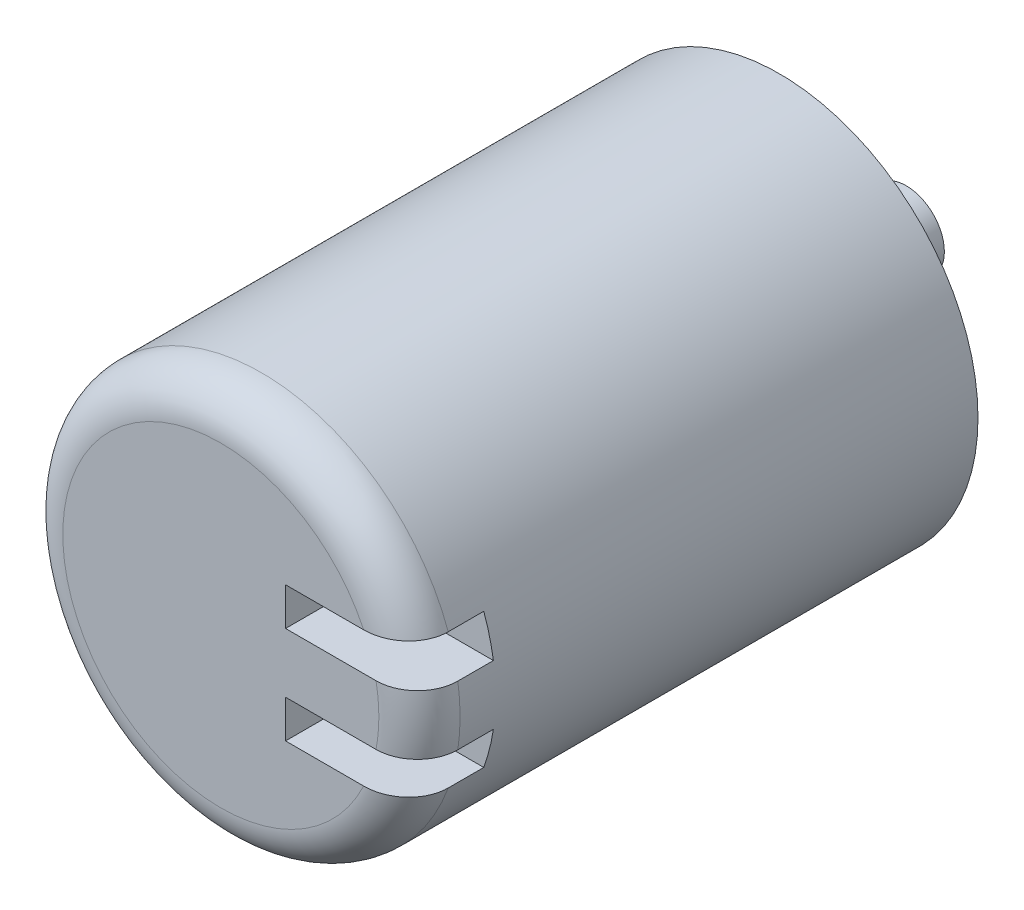
ISO-10303-21;
HEADER;
FILE_DESCRIPTION(('STEP AP214'),'2;1');
FILE_NAME('part.step','',(''),(''),'','','');
FILE_SCHEMA(('AUTOMOTIVE_DESIGN { 1 0 10303 214 1 1 1 1 }'));
ENDSEC;
DATA;
#1=APPLICATION_CONTEXT('core data for automotive mechanical design processes');
#2=APPLICATION_PROTOCOL_DEFINITION('international standard','automotive_design',2000,#1);
#3=PRODUCT_CONTEXT('',#1,'mechanical');
#4=PRODUCT('Part','Part','',(#3));
#5=PRODUCT_RELATED_PRODUCT_CATEGORY('part','',(#4));
#6=PRODUCT_DEFINITION_FORMATION('','',#4);
#7=PRODUCT_DEFINITION_CONTEXT('part definition',#1,'design');
#8=PRODUCT_DEFINITION('design','',#6,#7);
#9=PRODUCT_DEFINITION_SHAPE('','',#8);
#10=(LENGTH_UNIT() NAMED_UNIT(*) SI_UNIT(.MILLI.,.METRE.));
#11=(NAMED_UNIT(*) PLANE_ANGLE_UNIT() SI_UNIT($,.RADIAN.));
#12=(NAMED_UNIT(*) SI_UNIT($,.STERADIAN.) SOLID_ANGLE_UNIT());
#13=UNCERTAINTY_MEASURE_WITH_UNIT(LENGTH_MEASURE(1.E-05),#10,'distance_accuracy_value','');
#14=(GEOMETRIC_REPRESENTATION_CONTEXT(3) GLOBAL_UNCERTAINTY_ASSIGNED_CONTEXT((#13)) GLOBAL_UNIT_ASSIGNED_CONTEXT((#10,
#11,#12)) REPRESENTATION_CONTEXT('',''));
#15=CARTESIAN_POINT('',(0.,0.,0.));
#16=DIRECTION('',(0.,0.,1.));
#17=DIRECTION('',(1.,0.,0.));
#18=AXIS2_PLACEMENT_3D('',#15,#16,#17);
#19=CARTESIAN_POINT('',(-4.07535634801236,-1.33193562577725,9.5));
#20=DIRECTION('',(0.,-1.,0.));
#21=DIRECTION('',(0.,0.,-1.));
#22=AXIS2_PLACEMENT_3D('',#19,#20,#21);
#23=PLANE('',#22);
#24=DIRECTION('',(0.,0.,-1.));
#25=VECTOR('',#24,1.);
#26=CARTESIAN_POINT('',(-4.07535634801236,-1.33193562577725,9.5));
#27=LINE('',#26,#25);
#28=CARTESIAN_POINT('',(-4.07535634801236,-1.33193562577725,11.));
#29=VERTEX_POINT('',#28);
#30=CARTESIAN_POINT('',(-4.07535634801236,-1.33193562577725,9.5));
#31=VERTEX_POINT('',#30);
#32=EDGE_CURVE('E221',#29,#31,#27,.T.);
#33=ORIENTED_EDGE('',*,*,#32,.F.);
#34=DIRECTION('',(1.,0.,0.));
#35=VECTOR('',#34,1.);
#36=CARTESIAN_POINT('',(-4.07535634801236,-1.33193562577725,11.));
#37=LINE('',#36,#35);
#38=CARTESIAN_POINT('',(-2.53710223432503,-1.33193562577725,11.));
#39=VERTEX_POINT('',#38);
#40=EDGE_CURVE('E79',#39,#29,#37,.F.);
#41=ORIENTED_EDGE('',*,*,#40,.F.);
#42=CARTESIAN_POINT('',(-1.67140205343615,-1.33193562577725,10.1999999999985));
#43=CARTESIAN_POINT('',(-1.67140165054676,-1.33193562577725,10.2214744237064));
#44=CARTESIAN_POINT('',(-1.67232227136338,-1.33193562577725,10.2429382659585));
#45=CARTESIAN_POINT('',(-1.67599123290968,-1.33193562577725,10.2857060455526));
#46=CARTESIAN_POINT('',(-1.67873930703357,-1.33193562577725,10.3070100057611));
#47=CARTESIAN_POINT('',(-1.68968125109336,-1.33193562577725,10.3703538766242));
#48=CARTESIAN_POINT('',(-1.70057304800122,-1.33193562577725,10.411958906405));
#49=CARTESIAN_POINT('',(-1.72916270848239,-1.33193562577725,10.4927298335004));
#50=CARTESIAN_POINT('',(-1.7468606028666,-1.33193562577725,10.5318957197721));
#51=CARTESIAN_POINT('',(-1.78845084923562,-1.33193562577725,10.606794441343));
#52=CARTESIAN_POINT('',(-1.81234462396103,-1.33193562577725,10.6425264855533));
#53=CARTESIAN_POINT('',(-1.8661062026507,-1.33193562577725,10.7104026408855));
#54=CARTESIAN_POINT('',(-1.89608953891984,-1.33193562577725,10.7424550171935));
#55=CARTESIAN_POINT('',(-1.96076330730505,-1.33193562577725,10.8014028759915));
#56=CARTESIAN_POINT('',(-1.99545585296861,-1.33193562577725,10.8282960298085));
#57=CARTESIAN_POINT('',(-2.07059814783568,-1.33193562577725,10.877792289693));
#58=CARTESIAN_POINT('',(-2.11126162953667,-1.33193562577725,10.9000703280543));
#59=CARTESIAN_POINT('',(-2.19558003522611,-1.33193562577725,10.9380305353954));
#60=CARTESIAN_POINT('',(-2.23923712090477,-1.33193562577725,10.9537078784072));
#61=CARTESIAN_POINT('',(-2.32504022128543,-1.33193562577725,10.9774071260801));
#62=CARTESIAN_POINT('',(-2.36705396062065,-1.33193562577725,10.9859150399716));
#63=CARTESIAN_POINT('',(-2.45175309274365,-1.33193562577725,10.9972117699078));
#64=CARTESIAN_POINT('',(-2.49443681149817,-1.33193562577725,11.0000130806623));
#65=CARTESIAN_POINT('',(-2.53710223432503,-1.33193562577725,11.));
#66=B_SPLINE_CURVE_WITH_KNOTS('',3,(#42,#43,#44,#45,#46,#47,#48,#49,#50,#51,#52,#53,#54,#55,#56,
#57,#58,#59,#60,#61,#62,#63,#64,#65),.UNSPECIFIED.,.F.,.F.,(4,2,2,2,2,2,2,2,2,2,2,4),(0.,
0.0643826798207295,0.12875596896056,0.257108373130233,0.385461358352271,0.513843843008203,
0.644938250101479,0.776091689621036,0.914598486443513,1.05320637465872,1.1814177197519,
1.30934804076991),.UNSPECIFIED.);
#67=CARTESIAN_POINT('',(-1.67140205343136,-1.33193562577725,10.1999999999985));
#68=VERTEX_POINT('',#67);
#69=EDGE_CURVE('E219',#68,#39,#66,.T.);
#70=ORIENTED_EDGE('',*,*,#69,.F.);
#71=DIRECTION('',(0.,0.,-1.));
#72=VECTOR('',#71,1.);
#73=CARTESIAN_POINT('',(-1.67140205343615,-1.33193562577725,9.5));
#74=LINE('',#73,#72);
#75=CARTESIAN_POINT('',(-1.67140205343615,-1.33193562577725,9.5));
#76=VERTEX_POINT('',#75);
#77=EDGE_CURVE('E225',#76,#68,#74,.F.);
#78=ORIENTED_EDGE('',*,*,#77,.F.);
#79=DIRECTION('',(1.,0.,0.));
#80=VECTOR('',#79,1.);
#81=CARTESIAN_POINT('',(0.,-1.33193562577725,9.5));
#82=LINE('',#81,#80);
#83=EDGE_CURVE('E276',#31,#76,#82,.T.);
#84=ORIENTED_EDGE('',*,*,#83,.F.);
#85=EDGE_LOOP('',(#33,#41,#70,#78,#84));
#86=FACE_BOUND('',#85,.T.);
#87=ADVANCED_FACE('F16',(#86),#23,.F.);
#88=CARTESIAN_POINT('',(-4.07535634801236,1.33193562577725,9.5));
#89=DIRECTION('',(0.,1.,0.));
#90=DIRECTION('',(0.,0.,1.));
#91=AXIS2_PLACEMENT_3D('',#88,#89,#90);
#92=PLANE('',#91);
#93=DIRECTION('',(1.,0.,0.));
#94=VECTOR('',#93,1.);
#95=CARTESIAN_POINT('',(-4.07535634801236,1.33193562577725,11.));
#96=LINE('',#95,#94);
#97=CARTESIAN_POINT('',(-4.07535634801236,1.33193562577725,11.));
#98=VERTEX_POINT('',#97);
#99=CARTESIAN_POINT('',(-2.53710223432503,1.33193562577725,11.));
#100=VERTEX_POINT('',#99);
#101=EDGE_CURVE('E214',#98,#100,#96,.T.);
#102=ORIENTED_EDGE('',*,*,#101,.F.);
#103=DIRECTION('',(0.,0.,1.));
#104=VECTOR('',#103,1.);
#105=CARTESIAN_POINT('',(-4.07535634801236,1.33193562577725,9.5));
#106=LINE('',#105,#104);
#107=CARTESIAN_POINT('',(-4.07535634801236,1.33193562577725,9.5));
#108=VERTEX_POINT('',#107);
#109=EDGE_CURVE('E284',#98,#108,#106,.F.);
#110=ORIENTED_EDGE('',*,*,#109,.T.);
#111=DIRECTION('',(-1.,0.,0.));
#112=VECTOR('',#111,1.);
#113=CARTESIAN_POINT('',(0.,1.33193562577725,9.5));
#114=LINE('',#113,#112);
#115=CARTESIAN_POINT('',(-1.67140205343615,1.33193562577725,9.5));
#116=VERTEX_POINT('',#115);
#117=EDGE_CURVE('E315',#108,#116,#114,.F.);
#118=ORIENTED_EDGE('',*,*,#117,.T.);
#119=DIRECTION('',(0.,0.,1.));
#120=VECTOR('',#119,1.);
#121=CARTESIAN_POINT('',(-1.67140205343615,1.33193562577725,9.5));
#122=LINE('',#121,#120);
#123=CARTESIAN_POINT('',(-1.67140205343615,1.33193562577725,10.2));
#124=VERTEX_POINT('',#123);
#125=EDGE_CURVE('E223',#124,#116,#122,.F.);
#126=ORIENTED_EDGE('',*,*,#125,.F.);
#127=CARTESIAN_POINT('',(-2.53710223432503,1.33193562577725,11.));
#128=CARTESIAN_POINT('',(-2.48481463026785,1.33193562577725,11.000028913028));
#129=CARTESIAN_POINT('',(-2.43248892195368,1.33193562577725,10.9958108946577));
#130=CARTESIAN_POINT('',(-2.32909449117097,1.33193562577725,10.97879649022));
#131=CARTESIAN_POINT('',(-2.27803011966505,1.33193562577725,10.9659738145419));
#132=CARTESIAN_POINT('',(-2.17870753906514,1.33193562577725,10.9316219494132));
#133=CARTESIAN_POINT('',(-2.13045662484245,1.33193562577725,10.9100711858805));
#134=CARTESIAN_POINT('',(-2.06168691541354,1.33193562577725,10.8715279214236));
#135=CARTESIAN_POINT('',(-2.03937596678811,1.33193562577725,10.857653231228));
#136=CARTESIAN_POINT('',(-1.9961046289841,1.33193562577725,10.8278806604466));
#137=CARTESIAN_POINT('',(-1.97514594875519,1.33193562577725,10.8119802925082));
#138=CARTESIAN_POINT('',(-1.91743831061968,1.33193562577725,10.7637133221073));
#139=CARTESIAN_POINT('',(-1.88263831288286,1.33193562577725,10.7289604826349));
#140=CARTESIAN_POINT('',(-1.81997010936957,1.33193562577725,10.6536945007197));
#141=CARTESIAN_POINT('',(-1.79209672088269,1.33193562577725,10.6131857009603));
#142=CARTESIAN_POINT('',(-1.75724712742244,1.33193562577725,10.550678181728));
#143=CARTESIAN_POINT('',(-1.74708259431221,1.33193562577725,10.5304089605));
#144=CARTESIAN_POINT('',(-1.72858270503223,1.33193562577725,10.4890749872855));
#145=CARTESIAN_POINT('',(-1.72024585494879,1.33193562577725,10.4680109016395));
#146=CARTESIAN_POINT('',(-1.698120179862,1.33193562577725,10.4038705000261));
#147=CARTESIAN_POINT('',(-1.68716695474916,1.33193562577724,10.3597578278413));
#148=CARTESIAN_POINT('',(-1.6773054654801,1.33193562577725,10.2960395960915));
#149=CARTESIAN_POINT('',(-1.67509187230948,1.33193562577725,10.2768837088074));
#150=CARTESIAN_POINT('',(-1.67214210744072,1.33193562577724,10.238489529604));
#151=CARTESIAN_POINT('',(-1.67140356098154,1.33193562577723,10.2192514201915));
#152=CARTESIAN_POINT('',(-1.67140205343614,1.33193562577721,10.2));
#153=B_SPLINE_CURVE_WITH_KNOTS('',3,(#127,#128,#129,#130,#131,#132,#133,#134,#135,#136,#137,
#138,#139,#140,#141,#142,#143,#144,#145,#146,#147,#148,#149,#150,#151,#152),.UNSPECIFIED.,.F.,
.F.,(4,2,2,2,2,2,2,2,2,2,2,2,4),(0.,0.156745298257852,0.313971690516111,0.471589110136094,
0.550312068181136,0.629132639930387,0.775845977314503,0.922449206303364,0.990397351347255,
1.05828974805088,1.19377544291971,1.25158219802554,1.30929581150765),.UNSPECIFIED.);
#154=EDGE_CURVE('E71',#100,#124,#153,.T.);
#155=ORIENTED_EDGE('',*,*,#154,.F.);
#156=EDGE_LOOP('',(#102,#110,#118,#126,#155));
#157=FACE_BOUND('',#156,.T.);
#158=ADVANCED_FACE('F343',(#157),#92,.F.);
#159=CARTESIAN_POINT('',(0.,0.,9.5));
#160=DIRECTION('',(0.,0.,1.));
#161=DIRECTION('',(1.,0.,0.));
#162=AXIS2_PLACEMENT_3D('',#159,#160,#161);
#163=PLANE('',#162);
#164=DIRECTION('',(0.,1.,0.));
#165=VECTOR('',#164,1.);
#166=CARTESIAN_POINT('',(-4.07535634801236,-0.586087769145235,9.5));
#167=LINE('',#166,#165);
#168=CARTESIAN_POINT('',(-4.07535634801236,-0.586087769145235,9.5));
#169=VERTEX_POINT('',#168);
#170=EDGE_CURVE('E291',#169,#31,#167,.F.);
#171=ORIENTED_EDGE('',*,*,#170,.T.);
#172=ORIENTED_EDGE('',*,*,#83,.T.);
#173=CARTESIAN_POINT('',(-5.35,0.,9.5));
#174=DIRECTION('',(0.,0.,-1.));
#175=DIRECTION('',(-1.,0.,0.));
#176=AXIS2_PLACEMENT_3D('',#173,#174,#175);
#177=CIRCLE('',#176,3.91230563270284);
#178=CARTESIAN_POINT('',(-1.48184326965197,-0.586087769145235,9.5));
#179=VERTEX_POINT('',#178);
#180=EDGE_CURVE('E274',#76,#179,#177,.F.);
#181=ORIENTED_EDGE('',*,*,#180,.T.);
#182=DIRECTION('',(1.,0.,0.));
#183=VECTOR('',#182,1.);
#184=CARTESIAN_POINT('',(-4.07535634801236,-0.586087769145235,9.5));
#185=LINE('',#184,#183);
#186=EDGE_CURVE('E303',#179,#169,#185,.F.);
#187=ORIENTED_EDGE('',*,*,#186,.T.);
#188=EDGE_LOOP('',(#171,#172,#181,#187));
#189=FACE_BOUND('',#188,.T.);
#190=ADVANCED_FACE('F310',(#189),#163,.T.);
#191=CARTESIAN_POINT('',(-4.07535634801236,-0.586087769145235,9.5));
#192=DIRECTION('',(-1.,0.,0.));
#193=DIRECTION('',(0.,0.,1.));
#194=AXIS2_PLACEMENT_3D('',#191,#192,#193);
#195=PLANE('',#194);
#196=ORIENTED_EDGE('',*,*,#32,.T.);
#197=ORIENTED_EDGE('',*,*,#170,.F.);
#198=DIRECTION('',(0.,0.,1.));
#199=VECTOR('',#198,1.);
#200=CARTESIAN_POINT('',(-4.07535634801236,-0.586087769145235,9.5));
#201=LINE('',#200,#199);
#202=CARTESIAN_POINT('',(-4.07535634801236,-0.586087769145235,11.));
#203=VERTEX_POINT('',#202);
#204=EDGE_CURVE('E305',#169,#203,#201,.T.);
#205=ORIENTED_EDGE('',*,*,#204,.T.);
#206=DIRECTION('',(0.,1.,0.));
#207=VECTOR('',#206,1.);
#208=CARTESIAN_POINT('',(-4.07535634801236,-0.586087769145235,11.));
#209=LINE('',#208,#207);
#210=EDGE_CURVE('E285',#29,#203,#209,.T.);
#211=ORIENTED_EDGE('',*,*,#210,.F.);
#212=EDGE_LOOP('',(#196,#197,#205,#211));
#213=FACE_BOUND('',#212,.T.);
#214=ADVANCED_FACE('F347',(#213),#195,.F.);
#215=CARTESIAN_POINT('',(-4.07535634801236,0.586087769145235,9.5));
#216=DIRECTION('',(-1.,0.,0.));
#217=DIRECTION('',(0.,0.,1.));
#218=AXIS2_PLACEMENT_3D('',#215,#216,#217);
#219=PLANE('',#218);
#220=DIRECTION('',(0.,0.,-1.));
#221=VECTOR('',#220,1.);
#222=CARTESIAN_POINT('',(-4.07535634801236,0.586087769145235,9.5));
#223=LINE('',#222,#221);
#224=CARTESIAN_POINT('',(-4.07535634801236,0.586087769145235,11.));
#225=VERTEX_POINT('',#224);
#226=CARTESIAN_POINT('',(-4.07535634801236,0.586087769145235,9.5));
#227=VERTEX_POINT('',#226);
#228=EDGE_CURVE('E329',#225,#227,#223,.T.);
#229=ORIENTED_EDGE('',*,*,#228,.T.);
#230=DIRECTION('',(0.,1.,0.));
#231=VECTOR('',#230,1.);
#232=CARTESIAN_POINT('',(-4.07535634801236,0.,9.5));
#233=LINE('',#232,#231);
#234=EDGE_CURVE('E272',#227,#108,#233,.T.);
#235=ORIENTED_EDGE('',*,*,#234,.T.);
#236=ORIENTED_EDGE('',*,*,#109,.F.);
#237=DIRECTION('',(0.,1.,0.));
#238=VECTOR('',#237,1.);
#239=CARTESIAN_POINT('',(-4.07535634801236,0.586087769145235,11.));
#240=LINE('',#239,#238);
#241=EDGE_CURVE('E273',#225,#98,#240,.T.);
#242=ORIENTED_EDGE('',*,*,#241,.F.);
#243=EDGE_LOOP('',(#229,#235,#236,#242));
#244=FACE_BOUND('',#243,.T.);
#245=ADVANCED_FACE('F337',(#244),#219,.F.);
#246=CARTESIAN_POINT('',(0.,0.,9.5));
#247=DIRECTION('',(0.,0.,-1.));
#248=DIRECTION('',(-1.,0.,0.));
#249=AXIS2_PLACEMENT_3D('',#246,#247,#248);
#250=PLANE('',#249);
#251=ORIENTED_EDGE('',*,*,#234,.F.);
#252=DIRECTION('',(1.,0.,0.));
#253=VECTOR('',#252,1.);
#254=CARTESIAN_POINT('',(-4.07535634801236,0.586087769145235,9.5));
#255=LINE('',#254,#253);
#256=CARTESIAN_POINT('',(-1.48184326965197,0.586087769145235,9.5));
#257=VERTEX_POINT('',#256);
#258=EDGE_CURVE('E326',#227,#257,#255,.T.);
#259=ORIENTED_EDGE('',*,*,#258,.T.);
#260=CARTESIAN_POINT('',(-5.35,0.,9.5));
#261=DIRECTION('',(0.,0.,-1.));
#262=DIRECTION('',(-1.,0.,0.));
#263=AXIS2_PLACEMENT_3D('',#260,#261,#262);
#264=CIRCLE('',#263,3.91230563270284);
#265=EDGE_CURVE('E270',#116,#257,#264,.T.);
#266=ORIENTED_EDGE('',*,*,#265,.F.);
#267=ORIENTED_EDGE('',*,*,#117,.F.);
#268=EDGE_LOOP('',(#251,#259,#266,#267));
#269=FACE_BOUND('',#268,.T.);
#270=ADVANCED_FACE('F342',(#269),#250,.F.);
#271=CARTESIAN_POINT('',(-5.35,0.,-2.5));
#272=DIRECTION('',(0.,0.,-1.));
#273=DIRECTION('',(-1.,0.,0.));
#274=AXIS2_PLACEMENT_3D('',#271,#272,#273);
#275=PLANE('',#274);
#276=CARTESIAN_POINT('',(-5.35,0.,-2.5));
#277=DIRECTION('',(0.,0.,1.));
#278=DIRECTION('',(1.,0.,0.));
#279=AXIS2_PLACEMENT_3D('',#276,#277,#278);
#280=CIRCLE('',#279,0.750000000000001);
#281=CARTESIAN_POINT('',(-4.6,0.,-2.5));
#282=VERTEX_POINT('',#281);
#283=EDGE_CURVE('E241',#282,#282,#280,.T.);
#284=ORIENTED_EDGE('',*,*,#283,.F.);
#285=EDGE_LOOP('',(#284));
#286=FACE_BOUND('',#285,.T.);
#287=ADVANCED_FACE('F416',(#286),#275,.T.);
#288=CARTESIAN_POINT('',(-4.07535634801236,-0.586087769145235,9.5));
#289=DIRECTION('',(0.,1.,0.));
#290=DIRECTION('',(0.,0.,1.));
#291=AXIS2_PLACEMENT_3D('',#288,#289,#290);
#292=PLANE('',#291);
#293=DIRECTION('',(1.,0.,0.));
#294=VECTOR('',#293,1.);
#295=CARTESIAN_POINT('',(-5.35,-0.586087769145235,11.));
#296=LINE('',#295,#294);
#297=CARTESIAN_POINT('',(-2.29337645788491,-0.586087769145235,11.));
#298=VERTEX_POINT('',#297);
#299=EDGE_CURVE('E113',#203,#298,#296,.T.);
#300=ORIENTED_EDGE('',*,*,#299,.F.);
#301=ORIENTED_EDGE('',*,*,#204,.F.);
#302=ORIENTED_EDGE('',*,*,#186,.F.);
#303=DIRECTION('',(0.,0.,1.));
#304=VECTOR('',#303,1.);
#305=CARTESIAN_POINT('',(-1.48184326965197,-0.586087769145235,9.5));
#306=LINE('',#305,#304);
#307=CARTESIAN_POINT('',(-1.48184326965197,-0.586087769145235,10.2));
#308=VERTEX_POINT('',#307);
#309=EDGE_CURVE('E306',#308,#179,#306,.F.);
#310=ORIENTED_EDGE('',*,*,#309,.F.);
#311=CARTESIAN_POINT('',(-2.29337645788491,-0.586087769145234,11.));
#312=CARTESIAN_POINT('',(-2.24717735756786,-0.586087769145235,11.0000377288361));
#313=CARTESIAN_POINT('',(-2.20098016066912,-0.586087769145235,10.9961419769896));
#314=CARTESIAN_POINT('',(-2.10988745782136,-0.586087769145234,10.9807136833916));
#315=CARTESIAN_POINT('',(-2.06499171658893,-0.586087769145234,10.9691825311053));
#316=CARTESIAN_POINT('',(-1.97774685300906,-0.586087769145233,10.9387011541646));
#317=CARTESIAN_POINT('',(-1.93539981616855,-0.586087769145234,10.919744946587));
#318=CARTESIAN_POINT('',(-1.85455163204459,-0.586087769145236,10.8749253363323));
#319=CARTESIAN_POINT('',(-1.81604902806125,-0.586087769145237,10.8490645636253));
#320=CARTESIAN_POINT('',(-1.74440726937416,-0.586087769145237,10.791441698109));
#321=CARTESIAN_POINT('',(-1.71121637964129,-0.586087769145235,10.7597439449749));
#322=CARTESIAN_POINT('',(-1.65071977876574,-0.586087769145234,10.6911587261869));
#323=CARTESIAN_POINT('',(-1.6234133027942,-0.586087769145235,10.6542719360113));
#324=CARTESIAN_POINT('',(-1.57583693563851,-0.586087769145235,10.5768890414081));
#325=CARTESIAN_POINT('',(-1.55547864005063,-0.586087769145235,10.5364472099213));
#326=CARTESIAN_POINT('',(-1.52192922064046,-0.586087769145235,10.4527075881075));
#327=CARTESIAN_POINT('',(-1.50873262567131,-0.586087769145236,10.4094120063279));
#328=CARTESIAN_POINT('',(-1.49350612778339,-0.586087769145238,10.3381667959691));
#329=CARTESIAN_POINT('',(-1.48913486802515,-0.586087769145239,10.3106958810569));
#330=CARTESIAN_POINT('',(-1.48330423440742,-0.586087769145231,10.2554874572077));
#331=CARTESIAN_POINT('',(-1.48184061247279,-0.586087769145221,10.2277503967775));
#332=CARTESIAN_POINT('',(-1.48184326965197,-0.586087769145202,10.2));
#333=B_SPLINE_CURVE_WITH_KNOTS('',3,(#311,#312,#313,#314,#315,#316,#317,#318,#319,#320,#321,
#322,#323,#324,#325,#326,#327,#328,#329,#330,#331,#332),.UNSPECIFIED.,.F.,.F.,(4,2,2,2,2,2,2,2,
2,2,4),(0.,0.13843138660723,0.276837588841686,0.415355545503826,0.55382081533632,
0.690842416001091,0.827846196476957,0.963035465741783,1.09812131190718,1.18142967142772,
1.26461622719324),.UNSPECIFIED.);
#334=EDGE_CURVE('E186',#298,#308,#333,.T.);
#335=ORIENTED_EDGE('',*,*,#334,.F.);
#336=EDGE_LOOP('',(#300,#301,#302,#310,#335));
#337=FACE_BOUND('',#336,.T.);
#338=ADVANCED_FACE('F250',(#337),#292,.F.);
#339=CARTESIAN_POINT('',(-4.07535634801236,0.586087769145235,9.5));
#340=DIRECTION('',(0.,-1.,0.));
#341=DIRECTION('',(0.,0.,-1.));
#342=AXIS2_PLACEMENT_3D('',#339,#340,#341);
#343=PLANE('',#342);
#344=ORIENTED_EDGE('',*,*,#228,.F.);
#345=DIRECTION('',(1.,0.,0.));
#346=VECTOR('',#345,1.);
#347=CARTESIAN_POINT('',(-5.35,0.586087769145235,11.));
#348=LINE('',#347,#346);
#349=CARTESIAN_POINT('',(-2.29337645788491,0.586087769145235,11.));
#350=VERTEX_POINT('',#349);
#351=EDGE_CURVE('E116',#350,#225,#348,.F.);
#352=ORIENTED_EDGE('',*,*,#351,.F.);
#353=CARTESIAN_POINT('',(-1.48184326965197,0.586087769145235,10.2));
#354=CARTESIAN_POINT('',(-1.48180335242184,0.586087769145235,10.2446153791735));
#355=CARTESIAN_POINT('',(-1.48561563438892,0.586087769145235,10.289216913351));
#356=CARTESIAN_POINT('',(-1.50064722862651,0.586087769145235,10.3771070662159));
#357=CARTESIAN_POINT('',(-1.51185864942483,0.586087769145235,10.4203970323501));
#358=CARTESIAN_POINT('',(-1.54139807066382,0.586087769145235,10.5044955132701));
#359=CARTESIAN_POINT('',(-1.55972884654226,0.586087769145235,10.545303053112));
#360=CARTESIAN_POINT('',(-1.60294827138367,0.586087769145235,10.6232748869926));
#361=CARTESIAN_POINT('',(-1.62783626831688,0.586087769145235,10.6604395427646));
#362=CARTESIAN_POINT('',(-1.68356662045712,0.586087769145235,10.7302607605644));
#363=CARTESIAN_POINT('',(-1.71443422676849,0.586087769145235,10.7628971601487));
#364=CARTESIAN_POINT('',(-1.78116031963951,0.586087769145235,10.8225929152683));
#365=CARTESIAN_POINT('',(-1.81701923197145,0.586087769145235,10.8496517945366));
#366=CARTESIAN_POINT('',(-1.89312173339508,0.586087769145235,10.8977486597632));
#367=CARTESIAN_POINT('',(-1.93340934480615,0.586087769145235,10.9187169028129));
#368=CARTESIAN_POINT('',(-2.01689535766102,0.586087769145235,10.9536914123236));
#369=CARTESIAN_POINT('',(-2.06009281340466,0.586087769145235,10.9676999284192));
#370=CARTESIAN_POINT('',(-2.13513107988259,0.586087769145235,10.9853607292323));
#371=CARTESIAN_POINT('',(-2.16655296541283,0.586087769145235,10.9908504629396));
#372=CARTESIAN_POINT('',(-2.22977208943416,0.586087769145235,10.9981698801422));
#373=CARTESIAN_POINT('',(-2.26156868760285,0.586087769145235,11.0000050924699));
#374=CARTESIAN_POINT('',(-2.29337645788491,0.586087769145235,11.));
#375=B_SPLINE_CURVE_WITH_KNOTS('',3,(#353,#354,#355,#356,#357,#358,#359,#360,#361,#362,#363,
#364,#365,#366,#367,#368,#369,#370,#371,#372,#373,#374),.UNSPECIFIED.,.F.,.F.,(4,2,2,2,2,2,2,2,
2,2,4),(0.,0.133663246692406,0.267184166164563,0.400757190297113,0.534316937351201,
0.668453493713815,0.802601499317892,0.938229977312255,1.07381458672566,1.16930716316548,
1.26465516122471),.UNSPECIFIED.);
#376=CARTESIAN_POINT('',(-1.48184326965197,0.586087769145235,10.2));
#377=VERTEX_POINT('',#376);
#378=EDGE_CURVE('E122',#377,#350,#375,.T.);
#379=ORIENTED_EDGE('',*,*,#378,.F.);
#380=DIRECTION('',(0.,0.,-1.));
#381=VECTOR('',#380,1.);
#382=CARTESIAN_POINT('',(-1.48184326965197,0.586087769145235,9.5));
#383=LINE('',#382,#381);
#384=EDGE_CURVE('E132',#257,#377,#383,.F.);
#385=ORIENTED_EDGE('',*,*,#384,.F.);
#386=ORIENTED_EDGE('',*,*,#258,.F.);
#387=EDGE_LOOP('',(#344,#352,#379,#385,#386));
#388=FACE_BOUND('',#387,.T.);
#389=ADVANCED_FACE('F258',(#388),#343,.F.);
#390=CARTESIAN_POINT('',(-5.35,0.,-2.5));
#391=DIRECTION('',(0.,0.,1.));
#392=DIRECTION('',(1.,0.,0.));
#393=AXIS2_PLACEMENT_3D('',#390,#391,#392);
#394=CYLINDRICAL_SURFACE('',#393,0.750000000000001);
#395=ORIENTED_EDGE('',*,*,#283,.T.);
#396=EDGE_LOOP('',(#395));
#397=FACE_BOUND('',#396,.T.);
#398=CARTESIAN_POINT('',(-5.35,0.,0.));
#399=DIRECTION('',(0.,0.,1.));
#400=DIRECTION('',(1.,0.,0.));
#401=AXIS2_PLACEMENT_3D('',#398,#399,#400);
#402=CIRCLE('',#401,0.750000000000001);
#403=CARTESIAN_POINT('',(-4.6,0.,0.));
#404=VERTEX_POINT('',#403);
#405=EDGE_CURVE('E124',#404,#404,#402,.F.);
#406=ORIENTED_EDGE('',*,*,#405,.T.);
#407=EDGE_LOOP('',(#406));
#408=FACE_BOUND('',#407,.T.);
#409=ADVANCED_FACE('F256',(#397,#408),#394,.T.);
#410=CARTESIAN_POINT('',(-5.35,0.,11.));
#411=DIRECTION('',(0.,0.,1.));
#412=DIRECTION('',(1.,0.,0.));
#413=AXIS2_PLACEMENT_3D('',#410,#411,#412);
#414=PLANE('',#413);
#415=ORIENTED_EDGE('',*,*,#40,.T.);
#416=ORIENTED_EDGE('',*,*,#210,.T.);
#417=ORIENTED_EDGE('',*,*,#299,.T.);
#418=CARTESIAN_POINT('',(-5.35,0.,11.));
#419=DIRECTION('',(0.,0.,-1.));
#420=DIRECTION('',(1.,0.,0.));
#421=AXIS2_PLACEMENT_3D('',#418,#419,#420);
#422=CIRCLE('',#421,3.11230563270284);
#423=CARTESIAN_POINT('',(-2.23769436729716,0.,11.));
#424=VERTEX_POINT('',#423);
#425=EDGE_CURVE('E105',#298,#424,#422,.F.);
#426=ORIENTED_EDGE('',*,*,#425,.T.);
#427=CARTESIAN_POINT('',(-5.35,0.,11.));
#428=DIRECTION('',(0.,0.,-1.));
#429=DIRECTION('',(0.982109054457034,0.18831305093782,0.));
#430=AXIS2_PLACEMENT_3D('',#427,#428,#429);
#431=CIRCLE('',#430,3.11230563270284);
#432=EDGE_CURVE('E110',#350,#424,#431,.T.);
#433=ORIENTED_EDGE('',*,*,#432,.F.);
#434=ORIENTED_EDGE('',*,*,#351,.T.);
#435=ORIENTED_EDGE('',*,*,#241,.T.);
#436=ORIENTED_EDGE('',*,*,#101,.T.);
#437=CARTESIAN_POINT('',(-5.35,0.,11.));
#438=DIRECTION('',(0.,0.,-1.));
#439=DIRECTION('',(0.903798693842333,-0.427957849570367,0.));
#440=AXIS2_PLACEMENT_3D('',#437,#438,#439);
#441=CIRCLE('',#440,3.11230563270284);
#442=EDGE_CURVE('E154',#39,#100,#441,.T.);
#443=ORIENTED_EDGE('',*,*,#442,.F.);
#444=EDGE_LOOP('',(#415,#416,#417,#426,#433,#434,#435,#436,#443));
#445=FACE_BOUND('',#444,.T.);
#446=ADVANCED_FACE('F108',(#445),#414,.T.);
#447=CARTESIAN_POINT('',(-5.35,0.,10.2));
#448=DIRECTION('',(0.,0.,1.));
#449=DIRECTION('',(1.,0.,0.));
#450=AXIS2_PLACEMENT_3D('',#447,#448,#449);
#451=TOROIDAL_SURFACE('',#450,3.11230563270284,0.8);
#452=ORIENTED_EDGE('',*,*,#378,.T.);
#453=ORIENTED_EDGE('',*,*,#432,.T.);
#454=ORIENTED_EDGE('',*,*,#425,.F.);
#455=ORIENTED_EDGE('',*,*,#334,.T.);
#456=CARTESIAN_POINT('',(-5.35,0.,10.2));
#457=DIRECTION('',(0.,0.,-1.));
#458=DIRECTION('',(-1.,0.,0.));
#459=AXIS2_PLACEMENT_3D('',#456,#457,#458);
#460=CIRCLE('',#459,3.91230563270284);
#461=EDGE_CURVE('E37',#377,#308,#460,.T.);
#462=ORIENTED_EDGE('',*,*,#461,.F.);
#463=EDGE_LOOP('',(#452,#453,#454,#455,#462));
#464=FACE_BOUND('',#463,.T.);
#465=ADVANCED_FACE('F120',(#464),#451,.T.);
#466=CARTESIAN_POINT('',(-5.35,0.,0.));
#467=DIRECTION('',(0.,0.,1.));
#468=DIRECTION('',(1.,0.,0.));
#469=AXIS2_PLACEMENT_3D('',#466,#467,#468);
#470=PLANE('',#469);
#471=CARTESIAN_POINT('',(-5.35,0.,0.));
#472=DIRECTION('',(0.,0.,-1.));
#473=DIRECTION('',(-1.,0.,0.));
#474=AXIS2_PLACEMENT_3D('',#471,#472,#473);
#475=CIRCLE('',#474,3.91230563270284);
#476=CARTESIAN_POINT('',(-9.26230563270284,0.,0.));
#477=VERTEX_POINT('',#476);
#478=EDGE_CURVE('E28',#477,#477,#475,.F.);
#479=ORIENTED_EDGE('',*,*,#478,.F.);
#480=EDGE_LOOP('',(#479));
#481=FACE_BOUND('',#480,.T.);
#482=ORIENTED_EDGE('',*,*,#405,.F.);
#483=EDGE_LOOP('',(#482));
#484=FACE_BOUND('',#483,.T.);
#485=ADVANCED_FACE('F143',(#481,#484),#470,.F.);
#486=CARTESIAN_POINT('',(-5.35,0.,10.2));
#487=DIRECTION('',(0.,0.,1.));
#488=DIRECTION('',(1.,0.,0.));
#489=AXIS2_PLACEMENT_3D('',#486,#487,#488);
#490=TOROIDAL_SURFACE('',#489,3.11230563270284,0.8);
#491=CARTESIAN_POINT('',(-5.35,0.,10.2));
#492=DIRECTION('',(0.,0.,-1.));
#493=DIRECTION('',(-1.,0.,0.));
#494=AXIS2_PLACEMENT_3D('',#491,#492,#493);
#495=CIRCLE('',#494,3.91230563270284);
#496=EDGE_CURVE('E11',#68,#124,#495,.T.);
#497=ORIENTED_EDGE('',*,*,#496,.F.);
#498=ORIENTED_EDGE('',*,*,#69,.T.);
#499=ORIENTED_EDGE('',*,*,#442,.T.);
#500=ORIENTED_EDGE('',*,*,#154,.T.);
#501=EDGE_LOOP('',(#497,#498,#499,#500));
#502=FACE_BOUND('',#501,.T.);
#503=ADVANCED_FACE('F158',(#502),#490,.T.);
#504=CARTESIAN_POINT('',(-5.35,0.,11.));
#505=DIRECTION('',(0.,0.,-1.));
#506=DIRECTION('',(-1.,0.,0.));
#507=AXIS2_PLACEMENT_3D('',#504,#505,#506);
#508=CYLINDRICAL_SURFACE('',#507,3.91230563270284);
#509=ORIENTED_EDGE('',*,*,#478,.T.);
#510=EDGE_LOOP('',(#509));
#511=FACE_BOUND('',#510,.T.);
#512=ORIENTED_EDGE('',*,*,#265,.T.);
#513=ORIENTED_EDGE('',*,*,#384,.T.);
#514=ORIENTED_EDGE('',*,*,#461,.T.);
#515=ORIENTED_EDGE('',*,*,#309,.T.);
#516=ORIENTED_EDGE('',*,*,#180,.F.);
#517=ORIENTED_EDGE('',*,*,#77,.T.);
#518=ORIENTED_EDGE('',*,*,#496,.T.);
#519=ORIENTED_EDGE('',*,*,#125,.T.);
#520=EDGE_LOOP('',(#512,#513,#514,#515,#516,#517,#518,#519));
#521=FACE_BOUND('',#520,.T.);
#522=ADVANCED_FACE('F162',(#511,#521),#508,.T.);
#523=CLOSED_SHELL('',(#87,#158,#190,#214,#245,#270,#287,#338,#389,#409,#446,#465,#485,#503,#522));
#524=MANIFOLD_SOLID_BREP('B1',#523);
#525=ADVANCED_BREP_SHAPE_REPRESENTATION('',(#18,#524),#14);
#526=SHAPE_DEFINITION_REPRESENTATION(#9,#525);
ENDSEC;
END-ISO-10303-21;
